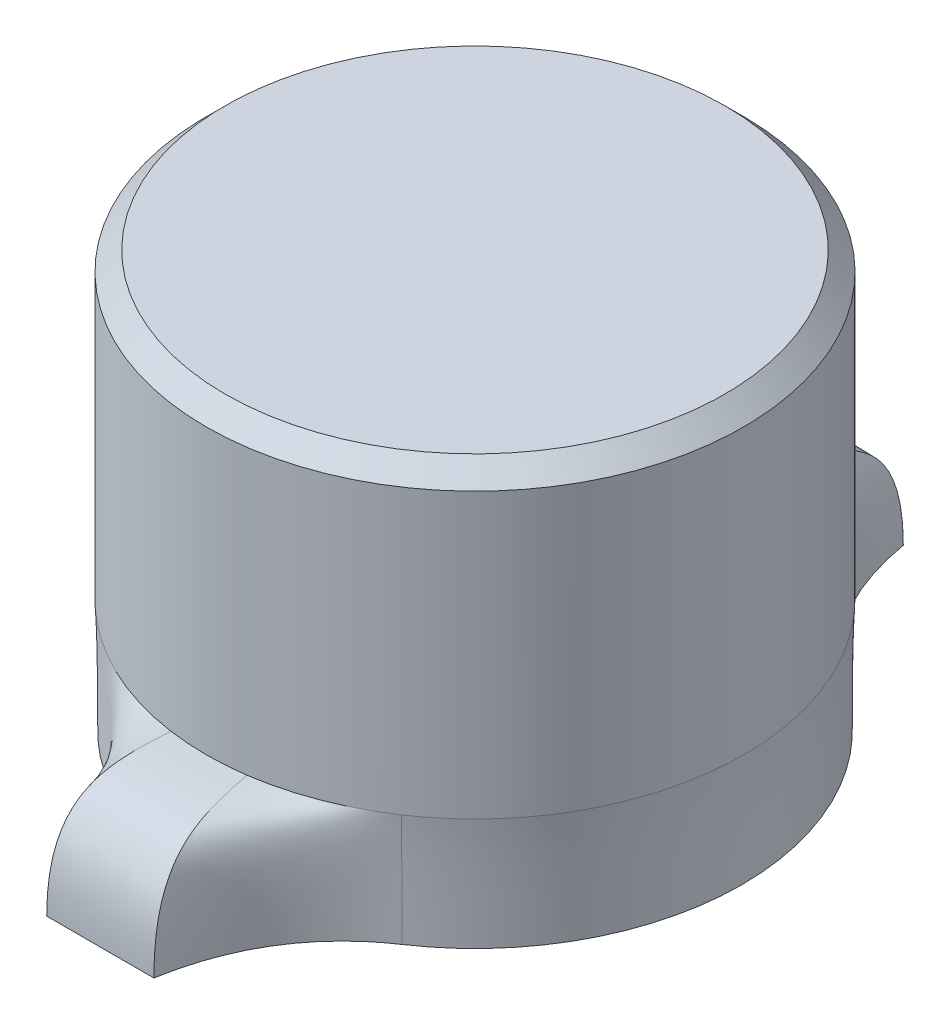
ISO-10303-21;
HEADER;
FILE_DESCRIPTION(('STEP AP214'),'2;1');
FILE_NAME('part.step','',(''),(''),'','','');
FILE_SCHEMA(('AUTOMOTIVE_DESIGN { 1 0 10303 214 1 1 1 1 }'));
ENDSEC;
DATA;
#1=APPLICATION_CONTEXT('core data for automotive mechanical design processes');
#2=APPLICATION_PROTOCOL_DEFINITION('international standard','automotive_design',2000,#1);
#3=PRODUCT_CONTEXT('',#1,'mechanical');
#4=PRODUCT('Part','Part','',(#3));
#5=PRODUCT_RELATED_PRODUCT_CATEGORY('part','',(#4));
#6=PRODUCT_DEFINITION_FORMATION('','',#4);
#7=PRODUCT_DEFINITION_CONTEXT('part definition',#1,'design');
#8=PRODUCT_DEFINITION('design','',#6,#7);
#9=PRODUCT_DEFINITION_SHAPE('','',#8);
#10=(LENGTH_UNIT() NAMED_UNIT(*) SI_UNIT(.MILLI.,.METRE.));
#11=(NAMED_UNIT(*) PLANE_ANGLE_UNIT() SI_UNIT($,.RADIAN.));
#12=(NAMED_UNIT(*) SI_UNIT($,.STERADIAN.) SOLID_ANGLE_UNIT());
#13=UNCERTAINTY_MEASURE_WITH_UNIT(LENGTH_MEASURE(1.E-05),#10,'distance_accuracy_value','');
#14=(GEOMETRIC_REPRESENTATION_CONTEXT(3) GLOBAL_UNCERTAINTY_ASSIGNED_CONTEXT((#13)) GLOBAL_UNIT_ASSIGNED_CONTEXT((#10,
#11,#12)) REPRESENTATION_CONTEXT('',''));
#15=CARTESIAN_POINT('',(0.,0.,0.));
#16=DIRECTION('',(0.,0.,1.));
#17=DIRECTION('',(1.,0.,0.));
#18=AXIS2_PLACEMENT_3D('',#15,#16,#17);
#19=CARTESIAN_POINT('',(1.13655702118914,0.,-3.77763648414754));
#20=DIRECTION('',(0.,1.,0.));
#21=DIRECTION('',(0.,0.,1.));
#22=AXIS2_PLACEMENT_3D('',#19,#20,#21);
#23=PLANE('',#22);
#24=CARTESIAN_POINT('',(1.96247958573641,0.,-2.92819037556779));
#25=CARTESIAN_POINT('',(1.03130029759988,0.,-3.55331035273494));
#26=CARTESIAN_POINT('',(0.749912191942432,0.,-4.73933566977271));
#27=CARTESIAN_POINT('',(0.740954408816708,0.,-4.77959771849171));
#28=CARTESIAN_POINT('',(0.735040319256628,0.,-4.80719858510832));
#29=CARTESIAN_POINT('',(0.726906872501117,0.,-4.84645219096614));
#30=CARTESIAN_POINT('',(0.716946385778272,0.,-4.89803442871411));
#31=CARTESIAN_POINT('',(0.709948844067109,0.,-4.93694569385975));
#32=CARTESIAN_POINT('',(0.707689800108747,0.,-4.94999999999999));
#33=B_SPLINE_CURVE_WITH_KNOTS('',2,(#24,#25,#26,#27,#28,#29,#30,#31,#32),.UNSPECIFIED.,.F.,.F.,
(3,1,1,1,1,1,1,3),(0.0154703258331792,0.910377379921368,0.930774849135814,0.941244332666333,
0.951713816196853,0.971028289718112,0.990342763239371,1.),.UNSPECIFIED.);
#34=CARTESIAN_POINT('',(1.96253754772381,0.,-2.92827682795063));
#35=VERTEX_POINT('',#34);
#36=CARTESIAN_POINT('',(0.707689800108747,0.,-4.94999999999999));
#37=VERTEX_POINT('',#36);
#38=EDGE_CURVE('E372',#35,#37,#33,.T.);
#39=ORIENTED_EDGE('',*,*,#38,.F.);
#40=CARTESIAN_POINT('',(0.,0.,0.));
#41=DIRECTION('',(0.,1.,0.));
#42=DIRECTION('',(0.,0.,1.));
#43=AXIS2_PLACEMENT_3D('',#40,#41,#42);
#44=CIRCLE('',#43,3.525);
#45=CARTESIAN_POINT('',(1.96247958573641,0.,2.9281903755678));
#46=VERTEX_POINT('',#45);
#47=EDGE_CURVE('E399',#46,#35,#44,.T.);
#48=ORIENTED_EDGE('',*,*,#47,.F.);
#49=CARTESIAN_POINT('',(0.707689800108747,0.,4.95000000000001));
#50=CARTESIAN_POINT('',(0.9380293494557,0.,3.61617778051121));
#51=CARTESIAN_POINT('',(1.96247958573641,0.,2.9281903755678));
#52=B_SPLINE_CURVE_WITH_KNOTS('',2,(#49,#50,#51),.UNSPECIFIED.,.F.,.F.,(3,3),
(0.0154703258331793,1.),.UNSPECIFIED.);
#53=CARTESIAN_POINT('',(0.707689800108747,0.,4.95000000000001));
#54=VERTEX_POINT('',#53);
#55=EDGE_CURVE('E396',#54,#46,#52,.T.);
#56=ORIENTED_EDGE('',*,*,#55,.F.);
#57=DIRECTION('',(1.,0.,0.));
#58=VECTOR('',#57,1.);
#59=CARTESIAN_POINT('',(0.707689800108747,0.,4.95000000000001));
#60=LINE('',#59,#58);
#61=CARTESIAN_POINT('',(-0.707689800108748,0.,4.95000000000001));
#62=VERTEX_POINT('',#61);
#63=EDGE_CURVE('E279',#62,#54,#60,.T.);
#64=ORIENTED_EDGE('',*,*,#63,.F.);
#65=CARTESIAN_POINT('',(-1.96247958573641,0.,2.9281903755678));
#66=CARTESIAN_POINT('',(-0.9380293494557,0.,3.61617778051121));
#67=CARTESIAN_POINT('',(-0.707689800108748,0.,4.95000000000001));
#68=B_SPLINE_CURVE_WITH_KNOTS('',2,(#65,#66,#67),.UNSPECIFIED.,.F.,.F.,(3,3),
(0.0154703258331794,1.),.UNSPECIFIED.);
#69=CARTESIAN_POINT('',(-1.96255032603318,0.,2.92829587832694));
#70=VERTEX_POINT('',#69);
#71=EDGE_CURVE('E385',#70,#62,#68,.T.);
#72=ORIENTED_EDGE('',*,*,#71,.F.);
#73=CARTESIAN_POINT('',(0.,0.,0.));
#74=DIRECTION('',(0.,1.,0.));
#75=DIRECTION('',(0.,0.,1.));
#76=AXIS2_PLACEMENT_3D('',#73,#74,#75);
#77=CIRCLE('',#76,3.525);
#78=CARTESIAN_POINT('',(-1.96255032597733,0.,-2.92829587836463));
#79=VERTEX_POINT('',#78);
#80=EDGE_CURVE('E376',#79,#70,#77,.T.);
#81=ORIENTED_EDGE('',*,*,#80,.F.);
#82=CARTESIAN_POINT('',(-0.707689800108748,0.,-4.94999999999999));
#83=CARTESIAN_POINT('',(-0.9380293494557,0.,-3.6161777805112));
#84=CARTESIAN_POINT('',(-1.96247958573641,0.,-2.92819037556779));
#85=B_SPLINE_CURVE_WITH_KNOTS('',2,(#82,#83,#84),.UNSPECIFIED.,.F.,.F.,(3,3),
(0.0154703258331794,1.),.UNSPECIFIED.);
#86=CARTESIAN_POINT('',(-0.707689800108748,0.,-4.94999999999999));
#87=VERTEX_POINT('',#86);
#88=EDGE_CURVE('E371',#87,#79,#85,.T.);
#89=ORIENTED_EDGE('',*,*,#88,.F.);
#90=DIRECTION('',(-1.,0.,0.));
#91=VECTOR('',#90,1.);
#92=CARTESIAN_POINT('',(0.707689800108747,0.,-4.94999999999999));
#93=LINE('',#92,#91);
#94=EDGE_CURVE('E363',#37,#87,#93,.T.);
#95=ORIENTED_EDGE('',*,*,#94,.F.);
#96=EDGE_LOOP('',(#39,#48,#56,#64,#72,#81,#89,#95));
#97=FACE_BOUND('',#96,.T.);
#98=ADVANCED_FACE('F197',(#97),#23,.F.);
#99=CARTESIAN_POINT('',(1.96247958573641,0.,2.92819037556779));
#100=CARTESIAN_POINT('',(1.96247958573641,1.00013887924517,2.92819037556779));
#101=CARTESIAN_POINT('',(1.96943873320356,1.25006943962258,2.93857402938186));
#102=CARTESIAN_POINT('',(1.97639788067071,1.5,2.94895768319593));
#103=CARTESIAN_POINT('',(2.46638857564861,0.,2.59046946984288));
#104=CARTESIAN_POINT('',(2.46638857564861,1.00063559559839,2.59046946984288));
#105=CARTESIAN_POINT('',(2.45157408352281,1.25031779779919,2.61544586447219));
#106=CARTESIAN_POINT('',(2.43675959139701,1.5,2.6404222591015));
#107=CARTESIAN_POINT('',(3.25481589708301,0.,1.68525278993552));
#108=CARTESIAN_POINT('',(3.25481589708301,1.00162902830484,1.68525278993552));
#109=CARTESIAN_POINT('',(3.24826734074965,1.25081451415242,1.73284390652526));
#110=CARTESIAN_POINT('',(3.24171878441628,1.5,1.78043502311501));
#111=CARTESIAN_POINT('',(3.66015788076462,0.,0.));
#112=CARTESIAN_POINT('',(3.66015788076462,0.999584981863177,0.));
#113=CARTESIAN_POINT('',(3.68267082762055,1.24979249093159,0.));
#114=CARTESIAN_POINT('',(3.70518377447649,1.5,0.));
#115=CARTESIAN_POINT('',(3.25481589708301,0.,-1.68525278993551));
#116=CARTESIAN_POINT('',(3.25481589708301,1.00090831669624,-1.68525278993551));
#117=CARTESIAN_POINT('',(3.24826734074965,1.25045415834812,-1.73284390652526));
#118=CARTESIAN_POINT('',(3.24171878441628,1.5,-1.780435023115));
#119=CARTESIAN_POINT('',(2.46638857564861,0.,-2.59046946984287));
#120=CARTESIAN_POINT('',(2.46638857564861,1.00231725601845,-2.59046946984287));
#121=CARTESIAN_POINT('',(2.45157408352281,1.25115862800923,-2.61544586447219));
#122=CARTESIAN_POINT('',(2.436759591397,1.5,-2.6404222591015));
#123=CARTESIAN_POINT('',(1.81842219417937,0.,-3.02489909156717));
#124=CARTESIAN_POINT('',(1.81842219417937,0.99951431917275,-3.02489909156717));
#125=CARTESIAN_POINT('',(1.83157193862804,1.24975715958638,-3.03105322500511));
#126=CARTESIAN_POINT('',(1.84472168307672,1.5,-3.03720735844305));
#127=CARTESIAN_POINT('',(1.51682826833258,0.,-3.26072854973546));
#128=CARTESIAN_POINT('',(1.51682826833258,0.99779561611791,-3.26072854973546));
#129=CARTESIAN_POINT('',(1.5637292504062,1.24889780805896,-3.21569165243903));
#130=CARTESIAN_POINT('',(1.61063023247981,1.5,-3.17065475514261));
#131=CARTESIAN_POINT('',(1.09524154045114,0.,-3.78912190953102));
#132=CARTESIAN_POINT('',(1.09524154045114,1.04109080561508,-3.78912190953102));
#133=CARTESIAN_POINT('',(1.18441341310105,1.27054540280754,-3.55488410511156));
#134=CARTESIAN_POINT('',(1.27358528575097,1.5,-3.3206463006921));
#135=CARTESIAN_POINT('',(0.822441327274623,0.,-4.40692434898846));
#136=CARTESIAN_POINT('',(0.822441327274623,1.17803902403366,-4.40692434898846));
#137=CARTESIAN_POINT('',(0.872601293916674,1.33901951201683,-3.92073378583123));
#138=CARTESIAN_POINT('',(0.922761260558726,1.5,-3.43454322267401));
#139=CARTESIAN_POINT('',(0.737275626971847,0.,-4.77903279068401));
#140=CARTESIAN_POINT('',(0.737275626971847,1.3200110947472,-4.77903279068401));
#141=CARTESIAN_POINT('',(0.698310104205635,1.4100055473736,-4.13543244065464));
#142=CARTESIAN_POINT('',(0.659344581439424,1.5,-3.49183209062528));
#143=CARTESIAN_POINT('',(0.707689800108747,0.,-4.94999999999999));
#144=CARTESIAN_POINT('',(0.707689800108747,1.39099713010398,-4.94999999999999));
#145=CARTESIAN_POINT('',(0.605058074709915,1.44549856505199,-4.23213315968923));
#146=CARTESIAN_POINT('',(0.502426349311082,1.5,-3.51426631937848));
#147=B_SPLINE_SURFACE_WITH_KNOTS('',3,3,((#99,#100,#101,#102),(#103,#104,#105,#106),(#107,#108,
#109,#110),(#111,#112,#113,#114),(#115,#116,#117,#118),(#119,#120,#121,#122),(#123,#124,#125,
#126),(#127,#128,#129,#130),(#131,#132,#133,#134),(#135,#136,#137,#138),(#139,#140,#141,#142),
(#143,#144,#145,#146)),.UNSPECIFIED.,.F.,.F.,.F.,(4,1,1,1,2,1,1,1,4),(4,4),(0.,
0.194397057612206,0.388794115224413,0.583191172836619,0.777588230448825,0.833191172836619,
0.888794115224413,0.944397057612206,1.),(0.,1.),.UNSPECIFIED.);
#148=CARTESIAN_POINT('',(0.707689800108747,0.,-4.94999999999999));
#149=CARTESIAN_POINT('',(0.707689800108747,1.39099713010398,-4.94999999999999));
#150=CARTESIAN_POINT('',(0.605058074709915,1.44549856505199,-4.23213315968923));
#151=CARTESIAN_POINT('',(0.502426349311082,1.5,-3.51426631937848));
#152=B_SPLINE_CURVE_WITH_KNOTS('',3,(#148,#149,#150,#151),.UNSPECIFIED.,.F.,.F.,(4,4),(0.,1.),.UNSPECIFIED.);
#153=CARTESIAN_POINT('',(0.502467431235617,1.5,-3.51455743418366));
#154=VERTEX_POINT('',#153);
#155=EDGE_CURVE('E424',#37,#154,#152,.T.);
#156=CARTESIAN_POINT('',(0.,1.5,0.));
#157=DIRECTION('',(0.,1.,0.));
#158=DIRECTION('',(0.,0.,1.));
#159=AXIS2_PLACEMENT_3D('',#156,#157,#158);
#160=CIRCLE('',#159,3.55);
#161=CARTESIAN_POINT('',(1.97658393742005,1.5,2.94923539473323));
#162=VERTEX_POINT('',#161);
#163=EDGE_CURVE('E213',#162,#154,#160,.T.);
#164=CARTESIAN_POINT('',(1.96247958573641,0.,2.92819037556779));
#165=CARTESIAN_POINT('',(1.96247958573641,1.00013887924517,2.92819037556779));
#166=CARTESIAN_POINT('',(1.96943873320356,1.25006943962258,2.93857402938186));
#167=CARTESIAN_POINT('',(1.97639788067071,1.5,2.94895768319593));
#168=B_SPLINE_CURVE_WITH_KNOTS('',3,(#164,#165,#166,#167),.UNSPECIFIED.,.F.,.F.,(4,4),(0.,1.),.UNSPECIFIED.);
#169=EDGE_CURVE('E265',#162,#46,#168,.F.);
#170=ORIENTED_EDGE('',*,*,#47,.T.);
#171=ORIENTED_EDGE('',*,*,#38,.T.);
#172=ORIENTED_EDGE('',*,*,#155,.T.);
#173=ORIENTED_EDGE('',*,*,#163,.F.);
#174=ORIENTED_EDGE('',*,*,#169,.T.);
#175=EDGE_LOOP('',(#170,#171,#172,#173,#174));
#176=FACE_BOUND('',#175,.T.);
#177=ADVANCED_FACE('F313',(#176),#147,.T.);
#178=CARTESIAN_POINT('',(0.707689800108747,0.,-4.94999999999999));
#179=CARTESIAN_POINT('',(0.707689800108747,1.39099713010398,-4.94999999999999));
#180=CARTESIAN_POINT('',(0.605058074709915,1.44549856505199,-4.23213315968923));
#181=CARTESIAN_POINT('',(0.502426349311082,1.5,-3.51426631937848));
#182=CARTESIAN_POINT('',(0.235896600036249,0.,-4.94999999999999));
#183=CARTESIAN_POINT('',(0.235896600036249,1.39099713010398,-4.94999999999999));
#184=CARTESIAN_POINT('',(0.202537476545426,1.44549856505199,-4.25595499886675));
#185=CARTESIAN_POINT('',(0.169178353054603,1.5,-3.5619099977335));
#186=CARTESIAN_POINT('',(-0.23589660003625,0.,-4.94999999999999));
#187=CARTESIAN_POINT('',(-0.23589660003625,1.39099713010398,-4.94999999999999));
#188=CARTESIAN_POINT('',(-0.202537476545427,1.44549856505199,-4.25595499886675));
#189=CARTESIAN_POINT('',(-0.169178353054604,1.5,-3.5619099977335));
#190=CARTESIAN_POINT('',(-0.707689800108748,0.,-4.94999999999999));
#191=CARTESIAN_POINT('',(-0.707689800108748,1.39099713010398,-4.94999999999999));
#192=CARTESIAN_POINT('',(-0.605058074709915,1.44549856505199,-4.23213315968923));
#193=CARTESIAN_POINT('',(-0.502426349311083,1.5,-3.51426631937848));
#194=B_SPLINE_SURFACE_WITH_KNOTS('',3,3,((#178,#179,#180,#181),(#182,#183,#184,#185),(#186,#187,
#188,#189),(#190,#191,#192,#193)),.UNSPECIFIED.,.F.,.F.,.F.,(4,4),(4,4),(0.,1.),(0.,1.),.UNSPECIFIED.);
#195=CARTESIAN_POINT('',(-0.707689800108748,0.,-4.94999999999999));
#196=CARTESIAN_POINT('',(-0.707689800108748,1.39099713010398,-4.94999999999999));
#197=CARTESIAN_POINT('',(-0.605058074709915,1.44549856505199,-4.23213315968923));
#198=CARTESIAN_POINT('',(-0.502426349311083,1.5,-3.51426631937848));
#199=B_SPLINE_CURVE_WITH_KNOTS('',3,(#195,#196,#197,#198),.UNSPECIFIED.,.F.,.F.,(4,4),(0.,1.),.UNSPECIFIED.);
#200=CARTESIAN_POINT('',(-0.502464614537509,1.5,-3.5145381322395));
#201=VERTEX_POINT('',#200);
#202=EDGE_CURVE('E426',#87,#201,#199,.T.);
#203=EDGE_CURVE('E222',#154,#201,#160,.T.);
#204=ORIENTED_EDGE('',*,*,#94,.T.);
#205=ORIENTED_EDGE('',*,*,#202,.T.);
#206=ORIENTED_EDGE('',*,*,#203,.F.);
#207=ORIENTED_EDGE('',*,*,#155,.F.);
#208=EDGE_LOOP('',(#204,#205,#206,#207));
#209=FACE_BOUND('',#208,.T.);
#210=ADVANCED_FACE('F460',(#209),#194,.T.);
#211=CARTESIAN_POINT('',(0.707689800108747,0.,4.95000000000001));
#212=CARTESIAN_POINT('',(0.707689800108747,1.39099713010399,4.95000000000001));
#213=CARTESIAN_POINT('',(0.605058074709914,1.44549856505199,4.23213315968924));
#214=CARTESIAN_POINT('',(0.502426349311081,1.5,3.51426631937848));
#215=CARTESIAN_POINT('',(0.861249499673382,0.,4.06078518700748));
#216=CARTESIAN_POINT('',(0.861249499673382,1.26071104648438,4.06078518700748));
#217=CARTESIAN_POINT('',(0.945593112327127,1.38035552324219,3.74981729740378));
#218=CARTESIAN_POINT('',(1.02993672498087,1.5,3.43884940780008));
#219=CARTESIAN_POINT('',(1.27951276154927,0.,3.38684864553007));
#220=CARTESIAN_POINT('',(1.27951276154927,1.13042496286477,3.38684864553007));
#221=CARTESIAN_POINT('',(1.40662807469172,1.31521248143239,3.31623716835647));
#222=CARTESIAN_POINT('',(1.53374338783418,1.5,3.24562569118286));
#223=CARTESIAN_POINT('',(1.96247958573641,0.,2.9281903755678));
#224=CARTESIAN_POINT('',(1.96247958573641,1.00013887924517,2.9281903755678));
#225=CARTESIAN_POINT('',(1.96943873320356,1.25006943962258,2.93857402938186));
#226=CARTESIAN_POINT('',(1.97639788067071,1.5,2.94895768319593));
#227=B_SPLINE_SURFACE_WITH_KNOTS('',3,3,((#211,#212,#213,#214),(#215,#216,#217,#218),(#219,#220,
#221,#222),(#223,#224,#225,#226)),.UNSPECIFIED.,.F.,.F.,.F.,(4,4),(4,4),(0.,1.),(0.,1.),.UNSPECIFIED.);
#228=CARTESIAN_POINT('',(0.502467746373316,1.5,3.5145603333931));
#229=VERTEX_POINT('',#228);
#230=EDGE_CURVE('E259',#229,#162,#160,.T.);
#231=CARTESIAN_POINT('',(0.707689800108747,0.,4.95000000000001));
#232=CARTESIAN_POINT('',(0.707689800108747,1.39099713010399,4.95000000000001));
#233=CARTESIAN_POINT('',(0.605058074709913,1.44549856505199,4.23213315968924));
#234=CARTESIAN_POINT('',(0.502426349311079,1.5,3.51426631937848));
#235=B_SPLINE_CURVE_WITH_KNOTS('',3,(#231,#232,#233,#234),.UNSPECIFIED.,.F.,.F.,(4,4),(0.,1.),.UNSPECIFIED.);
#236=EDGE_CURVE('E264',#54,#229,#235,.T.);
#237=ORIENTED_EDGE('',*,*,#55,.T.);
#238=ORIENTED_EDGE('',*,*,#169,.F.);
#239=ORIENTED_EDGE('',*,*,#230,.F.);
#240=ORIENTED_EDGE('',*,*,#236,.F.);
#241=EDGE_LOOP('',(#237,#238,#239,#240));
#242=FACE_BOUND('',#241,.T.);
#243=ADVANCED_FACE('F263',(#242),#227,.T.);
#244=CARTESIAN_POINT('',(-0.707689800108748,0.,-4.94999999999999));
#245=CARTESIAN_POINT('',(-0.707689800108748,1.39099713010398,-4.94999999999999));
#246=CARTESIAN_POINT('',(-0.605058074709916,1.44549856505199,-4.23213315968923));
#247=CARTESIAN_POINT('',(-0.502426349311083,1.5,-3.51426631937848));
#248=CARTESIAN_POINT('',(-0.742433277585171,0.,-4.7488117005015));
#249=CARTESIAN_POINT('',(-0.742433277585171,1.30863288869395,-4.7488117005015));
#250=CARTESIAN_POINT('',(-0.688094015858939,1.40431644434697,-4.12215115412617));
#251=CARTESIAN_POINT('',(-0.633754754132706,1.5,-3.49549060775084));
#252=CARTESIAN_POINT('',(-0.845362593626265,0.,-4.332516980516));
#253=CARTESIAN_POINT('',(-0.845362593626265,1.14390440587389,-4.332516980516));
#254=CARTESIAN_POINT('',(-0.86469680795198,1.32195220293695,-3.88872132493611));
#255=CARTESIAN_POINT('',(-0.884031022277695,1.5,-3.44492566935623));
#256=CARTESIAN_POINT('',(-1.13172184832898,0.,-3.73714310071315));
#257=CARTESIAN_POINT('',(-1.13172184832898,1.02765785044365,-3.73714310071315));
#258=CARTESIAN_POINT('',(-1.1871173232997,1.26382892522182,-3.5349246451051));
#259=CARTESIAN_POINT('',(-1.24251279827041,1.5,-3.33270618949705));
#260=CARTESIAN_POINT('',(-1.52731125853944,0.,-3.25509475851908));
#261=CARTESIAN_POINT('',(-1.52731125853944,0.998464996485637,-3.25509475851908));
#262=CARTESIAN_POINT('',(-1.56292514622117,1.24923249824282,-3.2165276674483));
#263=CARTESIAN_POINT('',(-1.5985390339029,1.5,-3.17796057637752));
#264=CARTESIAN_POINT('',(-1.8184384728261,0.,-3.02492369453905));
#265=CARTESIAN_POINT('',(-1.8184384728261,0.999682647032111,-3.02492369453905));
#266=CARTESIAN_POINT('',(-1.83158003343882,1.24984132351606,-3.03106555632348));
#267=CARTESIAN_POINT('',(-1.84472159405154,1.5,-3.03720741810792));
#268=CARTESIAN_POINT('',(-2.46638868123076,0.,-2.59046939908149));
#269=CARTESIAN_POINT('',(-2.46638868123076,1.00172761215261,-2.59046939908149));
#270=CARTESIAN_POINT('',(-2.45157409180129,1.25086380607631,-2.61544585892393));
#271=CARTESIAN_POINT('',(-2.43675950237182,1.5,-2.64042231876637));
#272=CARTESIAN_POINT('',(-3.25481596019491,0.,-1.6852526259353));
#273=CARTESIAN_POINT('',(-3.25481596019491,1.0011431475644,-1.6852526259353));
#274=CARTESIAN_POINT('',(-3.24826733007115,1.2505715737822,-1.73284391342848));
#275=CARTESIAN_POINT('',(-3.24171869994739,1.5,-1.78043520092165));
#276=CARTESIAN_POINT('',(-3.66015784833569,0.,-9.64221974833479E-10));
#277=CARTESIAN_POINT('',(-3.6601578483357,0.999647584039768,-9.64221974833479E-10));
#278=CARTESIAN_POINT('',(-3.68267083414704,1.24982379201988,5.56257514008895E-11));
#279=CARTESIAN_POINT('',(-3.70518381995839,1.5,1.07547347763526E-09));
#280=CARTESIAN_POINT('',(-3.25481596102141,0.,1.68525262460816));
#281=CARTESIAN_POINT('',(-3.25481596102141,1.00114378889829,1.68525262460816));
#282=CARTESIAN_POINT('',(-3.24826733002496,1.25057189444914,1.73284391340991));
#283=CARTESIAN_POINT('',(-3.24171869902851,1.5,1.78043520221166));
#284=CARTESIAN_POINT('',(-2.46638868177497,0.,2.59046939871676));
#285=CARTESIAN_POINT('',(-2.46638868177497,1.0017261160107,2.59046939871676));
#286=CARTESIAN_POINT('',(-2.45157409184396,1.25086305800535,2.61544585889533));
#287=CARTESIAN_POINT('',(-2.43675950191295,1.5,2.64042231907391));
#288=CARTESIAN_POINT('',(-1.81843847316549,0.,3.02492369431113));
#289=CARTESIAN_POINT('',(-1.81843847316549,0.999683074968475,3.02492369431113));
#290=CARTESIAN_POINT('',(-1.83158003337908,1.24984153748424,3.0310655563633));
#291=CARTESIAN_POINT('',(-1.84472159359267,1.5,3.03720741841546));
#292=CARTESIAN_POINT('',(-1.52731125912905,0.,3.25509475792943));
#293=CARTESIAN_POINT('',(-1.52731125912905,0.99846669996778,3.25509475792943));
#294=CARTESIAN_POINT('',(-1.56293048361163,1.24923334998389,3.21651987432443));
#295=CARTESIAN_POINT('',(-1.59854970809421,1.5,3.17794499071943));
#296=CARTESIAN_POINT('',(-1.13172184819423,0.,3.73714310070647));
#297=CARTESIAN_POINT('',(-1.13172184819423,1.027653618848,3.73714310070647));
#298=CARTESIAN_POINT('',(-1.1871135495636,1.263826809424,3.53493649506445));
#299=CARTESIAN_POINT('',(-1.24250525093297,1.5,3.33272988942243));
#300=CARTESIAN_POINT('',(-0.845362593178079,0.,4.33251698170333));
#301=CARTESIAN_POINT('',(-0.845362593178079,1.14390447169148,4.33251698170333));
#302=CARTESIAN_POINT('',(-0.864690072393089,1.32195223584574,3.88871947504876));
#303=CARTESIAN_POINT('',(-0.884017551608099,1.5,3.44492196839419));
#304=CARTESIAN_POINT('',(-0.742433277465786,0.,4.74881170119285));
#305=CARTESIAN_POINT('',(-0.742433277465786,1.30863291063315,4.74881170119285));
#306=CARTESIAN_POINT('',(-0.688094016093529,1.40431645531657,4.12215115442977));
#307=CARTESIAN_POINT('',(-0.633754754721272,1.5,3.49549060766669));
#308=CARTESIAN_POINT('',(-0.707689800108748,0.,4.95000000000001));
#309=CARTESIAN_POINT('',(-0.707689800108748,1.39099713010399,4.95000000000001));
#310=CARTESIAN_POINT('',(-0.605058074709916,1.44549856505199,4.23213315968924));
#311=CARTESIAN_POINT('',(-0.502426349311084,1.5,3.51426631937848));
#312=B_SPLINE_SURFACE_WITH_KNOTS('',3,3,((#244,#245,#246,#247),(#248,#249,#250,#251),(#252,#253,
#254,#255),(#256,#257,#258,#259),(#260,#261,#262,#263),(#264,#265,#266,#267),(#268,#269,#270,
#271),(#272,#273,#274,#275),(#276,#277,#278,#279),(#280,#281,#282,#283),(#284,#285,#286,#287),
(#288,#289,#290,#291),(#292,#293,#294,#295),(#296,#297,#298,#299),(#300,#301,#302,#303),(#304,
#305,#306,#307),(#308,#309,#310,#311)),.UNSPECIFIED.,.F.,.F.,.F.,(4,1,1,1,2,1,1,1,2,1,1,1,4),(4,
4),(0.,0.0454862874199483,0.0909725748398967,0.136458862259845,0.181945149679793,
0.340972574636044,0.499999999592295,0.659027424548546,0.818054849504796,0.863541137128597,
0.909027424752398,0.954513712376199,1.),(0.,1.),.UNSPECIFIED.);
#313=CARTESIAN_POINT('',(-0.707689800108748,0.,4.95000000000001));
#314=CARTESIAN_POINT('',(-0.707689800108748,1.39099713010399,4.95000000000001));
#315=CARTESIAN_POINT('',(-0.605058074709916,1.44549856505199,4.23213315968924));
#316=CARTESIAN_POINT('',(-0.502426349311084,1.5,3.51426631937848));
#317=B_SPLINE_CURVE_WITH_KNOTS('',3,(#313,#314,#315,#316),.UNSPECIFIED.,.F.,.F.,(4,4),(0.,1.),.UNSPECIFIED.);
#318=CARTESIAN_POINT('',(-0.50246430140712,1.5,3.51453529803968));
#319=VERTEX_POINT('',#318);
#320=EDGE_CURVE('E281',#62,#319,#317,.T.);
#321=EDGE_CURVE('E286',#201,#319,#160,.T.);
#322=ORIENTED_EDGE('',*,*,#88,.T.);
#323=ORIENTED_EDGE('',*,*,#80,.T.);
#324=ORIENTED_EDGE('',*,*,#71,.T.);
#325=ORIENTED_EDGE('',*,*,#320,.T.);
#326=ORIENTED_EDGE('',*,*,#321,.F.);
#327=ORIENTED_EDGE('',*,*,#202,.F.);
#328=EDGE_LOOP('',(#322,#323,#324,#325,#326,#327));
#329=FACE_BOUND('',#328,.T.);
#330=ADVANCED_FACE('F500',(#329),#312,.T.);
#331=CARTESIAN_POINT('',(-0.707689800108748,0.,4.95000000000001));
#332=CARTESIAN_POINT('',(-0.707689800108748,1.39099713010398,4.95000000000001));
#333=CARTESIAN_POINT('',(-0.605058074709916,1.44549856505199,4.23213315968924));
#334=CARTESIAN_POINT('',(-0.502426349311084,1.5,3.51426631937847));
#335=CARTESIAN_POINT('',(-0.23589660003625,0.,4.95000000000001));
#336=CARTESIAN_POINT('',(-0.23589660003625,1.39099713010399,4.95000000000001));
#337=CARTESIAN_POINT('',(-0.202537476545428,1.44549856505199,4.25595499886676));
#338=CARTESIAN_POINT('',(-0.169178353054606,1.5,3.5619099977335));
#339=CARTESIAN_POINT('',(0.235896600036249,0.,4.95000000000001));
#340=CARTESIAN_POINT('',(0.235896600036249,1.39099713010399,4.95000000000001));
#341=CARTESIAN_POINT('',(0.202537476545425,1.44549856505199,4.25595499886676));
#342=CARTESIAN_POINT('',(0.1691783530546,1.5,3.5619099977335));
#343=CARTESIAN_POINT('',(0.707689800108747,0.,4.95000000000001));
#344=CARTESIAN_POINT('',(0.707689800108747,1.39099713010399,4.95000000000001));
#345=CARTESIAN_POINT('',(0.605058074709913,1.44549856505199,4.23213315968924));
#346=CARTESIAN_POINT('',(0.502426349311079,1.5,3.51426631937848));
#347=B_SPLINE_SURFACE_WITH_KNOTS('',3,3,((#331,#332,#333,#334),(#335,#336,#337,#338),(#339,#340,
#341,#342),(#343,#344,#345,#346)),.UNSPECIFIED.,.F.,.F.,.F.,(4,4),(4,4),(0.,1.),(0.,1.),.UNSPECIFIED.);
#348=EDGE_CURVE('E276',#319,#229,#160,.T.);
#349=ORIENTED_EDGE('',*,*,#63,.T.);
#350=ORIENTED_EDGE('',*,*,#236,.T.);
#351=ORIENTED_EDGE('',*,*,#348,.F.);
#352=ORIENTED_EDGE('',*,*,#320,.F.);
#353=EDGE_LOOP('',(#349,#350,#351,#352));
#354=FACE_BOUND('',#353,.T.);
#355=ADVANCED_FACE('F274',(#354),#347,.T.);
#356=CARTESIAN_POINT('',(0.,5.5,0.));
#357=DIRECTION('',(0.,-1.,0.));
#358=DIRECTION('',(0.,0.,-1.));
#359=AXIS2_PLACEMENT_3D('',#356,#357,#358);
#360=CYLINDRICAL_SURFACE('',#359,3.55);
#361=CARTESIAN_POINT('',(0.,5.25,0.));
#362=DIRECTION('',(0.,1.,0.));
#363=DIRECTION('',(0.,0.,1.));
#364=AXIS2_PLACEMENT_3D('',#361,#362,#363);
#365=CIRCLE('',#364,3.55);
#366=CARTESIAN_POINT('',(0.,5.25,3.55));
#367=VERTEX_POINT('',#366);
#368=EDGE_CURVE('E12',#367,#367,#365,.F.);
#369=ORIENTED_EDGE('',*,*,#368,.T.);
#370=EDGE_LOOP('',(#369));
#371=FACE_BOUND('',#370,.T.);
#372=ORIENTED_EDGE('',*,*,#230,.T.);
#373=ORIENTED_EDGE('',*,*,#163,.T.);
#374=ORIENTED_EDGE('',*,*,#203,.T.);
#375=ORIENTED_EDGE('',*,*,#321,.T.);
#376=ORIENTED_EDGE('',*,*,#348,.T.);
#377=EDGE_LOOP('',(#372,#373,#374,#375,#376));
#378=FACE_BOUND('',#377,.T.);
#379=ADVANCED_FACE('F285',(#371,#378),#360,.T.);
#380=CARTESIAN_POINT('',(0.,5.5,0.));
#381=DIRECTION('',(0.,1.,0.));
#382=DIRECTION('',(0.,0.,1.));
#383=AXIS2_PLACEMENT_3D('',#380,#381,#382);
#384=PLANE('',#383);
#385=CARTESIAN_POINT('',(0.,5.5,0.));
#386=DIRECTION('',(0.,1.,0.));
#387=DIRECTION('',(0.,0.,1.));
#388=AXIS2_PLACEMENT_3D('',#385,#386,#387);
#389=CIRCLE('',#388,3.3);
#390=CARTESIAN_POINT('',(0.,5.5,3.3));
#391=VERTEX_POINT('',#390);
#392=EDGE_CURVE('E206',#391,#391,#389,.T.);
#393=ORIENTED_EDGE('',*,*,#392,.T.);
#394=EDGE_LOOP('',(#393));
#395=FACE_BOUND('',#394,.T.);
#396=ADVANCED_FACE('F308',(#395),#384,.T.);
#397=CARTESIAN_POINT('',(0.,5.5,0.));
#398=DIRECTION('',(0.,-1.,0.));
#399=DIRECTION('',(0.,0.,-1.));
#400=AXIS2_PLACEMENT_3D('',#397,#398,#399);
#401=CONICAL_SURFACE('',#400,3.3,0.785398163397445);
#402=ORIENTED_EDGE('',*,*,#368,.F.);
#403=EDGE_LOOP('',(#402));
#404=FACE_BOUND('',#403,.T.);
#405=ORIENTED_EDGE('',*,*,#392,.F.);
#406=EDGE_LOOP('',(#405));
#407=FACE_BOUND('',#406,.T.);
#408=ADVANCED_FACE('F200',(#404,#407),#401,.T.);
#409=CLOSED_SHELL('',(#98,#177,#210,#243,#330,#355,#379,#396,#408));
#410=MANIFOLD_SOLID_BREP('B2',#409);
#411=ADVANCED_BREP_SHAPE_REPRESENTATION('',(#18,#410),#14);
#412=SHAPE_DEFINITION_REPRESENTATION(#9,#411);
ENDSEC;
END-ISO-10303-21;
